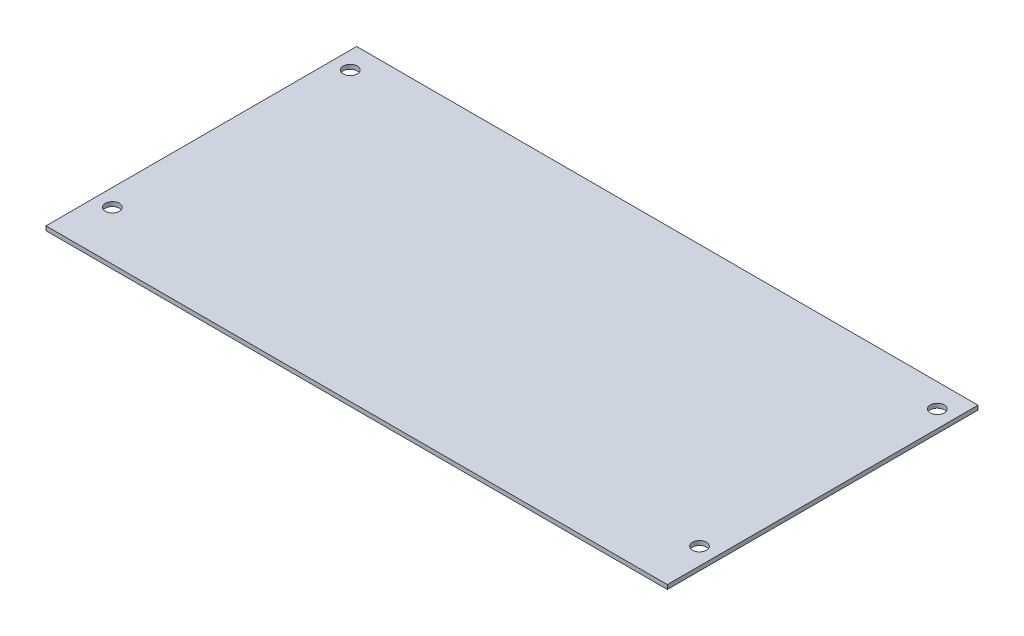
ISO-10303-21;
HEADER;
FILE_DESCRIPTION(('STEP AP214'),'2;1');
FILE_NAME('part.step','',(''),(''),'','','');
FILE_SCHEMA(('AUTOMOTIVE_DESIGN { 1 0 10303 214 1 1 1 1 }'));
ENDSEC;
DATA;
#1=APPLICATION_CONTEXT('core data for automotive mechanical design processes');
#2=APPLICATION_PROTOCOL_DEFINITION('international standard','automotive_design',2000,#1);
#3=PRODUCT_CONTEXT('',#1,'mechanical');
#4=PRODUCT('Part','Part','',(#3));
#5=PRODUCT_RELATED_PRODUCT_CATEGORY('part','',(#4));
#6=PRODUCT_DEFINITION_FORMATION('','',#4);
#7=PRODUCT_DEFINITION_CONTEXT('part definition',#1,'design');
#8=PRODUCT_DEFINITION('design','',#6,#7);
#9=PRODUCT_DEFINITION_SHAPE('','',#8);
#10=(LENGTH_UNIT() NAMED_UNIT(*) SI_UNIT(.MILLI.,.METRE.));
#11=(NAMED_UNIT(*) PLANE_ANGLE_UNIT() SI_UNIT($,.RADIAN.));
#12=(NAMED_UNIT(*) SI_UNIT($,.STERADIAN.) SOLID_ANGLE_UNIT());
#13=UNCERTAINTY_MEASURE_WITH_UNIT(LENGTH_MEASURE(1.E-05),#10,'distance_accuracy_value','');
#14=(GEOMETRIC_REPRESENTATION_CONTEXT(3) GLOBAL_UNCERTAINTY_ASSIGNED_CONTEXT((#13)) GLOBAL_UNIT_ASSIGNED_CONTEXT((#10,
#11,#12)) REPRESENTATION_CONTEXT('',''));
#15=CARTESIAN_POINT('',(0.,0.,0.));
#16=DIRECTION('',(0.,0.,1.));
#17=DIRECTION('',(1.,0.,0.));
#18=AXIS2_PLACEMENT_3D('',#15,#16,#17);
#19=CARTESIAN_POINT('',(0.,2.,0.));
#20=DIRECTION('',(0.,1.,0.));
#21=DIRECTION('',(0.,0.,1.));
#22=AXIS2_PLACEMENT_3D('',#19,#20,#21);
#23=PLANE('',#22);
#24=CARTESIAN_POINT('',(-8.,2.,-23.));
#25=DIRECTION('',(0.,1.,0.));
#26=DIRECTION('',(0.,0.,1.));
#27=AXIS2_PLACEMENT_3D('',#24,#25,#26);
#28=CIRCLE('',#27,3.25);
#29=CARTESIAN_POINT('',(-8.,2.,-19.75));
#30=VERTEX_POINT('',#29);
#31=EDGE_CURVE('E148',#30,#30,#28,.T.);
#32=ORIENTED_EDGE('',*,*,#31,.F.);
#33=EDGE_LOOP('',(#32));
#34=FACE_BOUND('',#33,.T.);
#35=CARTESIAN_POINT('',(-282.,2.,-134.));
#36=DIRECTION('',(0.,1.,0.));
#37=DIRECTION('',(0.,0.,1.));
#38=AXIS2_PLACEMENT_3D('',#35,#36,#37);
#39=CIRCLE('',#38,3.24999999999995);
#40=CARTESIAN_POINT('',(-282.,2.,-130.75));
#41=VERTEX_POINT('',#40);
#42=EDGE_CURVE('E118',#41,#41,#39,.T.);
#43=ORIENTED_EDGE('',*,*,#42,.F.);
#44=EDGE_LOOP('',(#43));
#45=FACE_BOUND('',#44,.T.);
#46=DIRECTION('',(0.,0.,-1.));
#47=VECTOR('',#46,1.);
#48=CARTESIAN_POINT('',(0.,2.,0.));
#49=LINE('',#48,#47);
#50=CARTESIAN_POINT('',(0.,2.,0.));
#51=VERTEX_POINT('',#50);
#52=CARTESIAN_POINT('',(0.,2.,-145.));
#53=VERTEX_POINT('',#52);
#54=EDGE_CURVE('E98',#51,#53,#49,.T.);
#55=ORIENTED_EDGE('',*,*,#54,.T.);
#56=DIRECTION('',(-1.,0.,0.));
#57=VECTOR('',#56,1.);
#58=CARTESIAN_POINT('',(0.,2.,-145.));
#59=LINE('',#58,#57);
#60=CARTESIAN_POINT('',(-290.,2.,-145.));
#61=VERTEX_POINT('',#60);
#62=EDGE_CURVE('E93',#53,#61,#59,.T.);
#63=ORIENTED_EDGE('',*,*,#62,.T.);
#64=DIRECTION('',(0.,0.,1.));
#65=VECTOR('',#64,1.);
#66=CARTESIAN_POINT('',(-290.,2.,0.));
#67=LINE('',#66,#65);
#68=CARTESIAN_POINT('',(-290.,2.,0.));
#69=VERTEX_POINT('',#68);
#70=EDGE_CURVE('E96',#61,#69,#67,.T.);
#71=ORIENTED_EDGE('',*,*,#70,.T.);
#72=DIRECTION('',(1.,0.,0.));
#73=VECTOR('',#72,1.);
#74=CARTESIAN_POINT('',(0.,2.,0.));
#75=LINE('',#74,#73);
#76=EDGE_CURVE('E63',#69,#51,#75,.T.);
#77=ORIENTED_EDGE('',*,*,#76,.T.);
#78=EDGE_LOOP('',(#55,#63,#71,#77));
#79=FACE_BOUND('',#78,.T.);
#80=CARTESIAN_POINT('',(-282.,2.,-23.));
#81=DIRECTION('',(0.,1.,0.));
#82=DIRECTION('',(0.,0.,1.));
#83=AXIS2_PLACEMENT_3D('',#80,#81,#82);
#84=CIRCLE('',#83,3.24999999999995);
#85=CARTESIAN_POINT('',(-282.,2.,-19.75));
#86=VERTEX_POINT('',#85);
#87=EDGE_CURVE('E140',#86,#86,#84,.T.);
#88=ORIENTED_EDGE('',*,*,#87,.F.);
#89=EDGE_LOOP('',(#88));
#90=FACE_BOUND('',#89,.T.);
#91=CARTESIAN_POINT('',(-8.,2.,-134.));
#92=DIRECTION('',(0.,1.,0.));
#93=DIRECTION('',(0.,0.,1.));
#94=AXIS2_PLACEMENT_3D('',#91,#92,#93);
#95=CIRCLE('',#94,3.25);
#96=CARTESIAN_POINT('',(-8.,2.,-130.75));
#97=VERTEX_POINT('',#96);
#98=EDGE_CURVE('E156',#97,#97,#95,.T.);
#99=ORIENTED_EDGE('',*,*,#98,.F.);
#100=EDGE_LOOP('',(#99));
#101=FACE_BOUND('',#100,.T.);
#102=ADVANCED_FACE('F45',(#34,#45,#79,#90,#101),#23,.T.);
#103=CARTESIAN_POINT('',(0.,0.,0.));
#104=DIRECTION('',(0.,1.,0.));
#105=DIRECTION('',(0.,0.,1.));
#106=AXIS2_PLACEMENT_3D('',#103,#104,#105);
#107=PLANE('',#106);
#108=DIRECTION('',(0.,0.,-1.));
#109=VECTOR('',#108,1.);
#110=CARTESIAN_POINT('',(0.,0.,0.));
#111=LINE('',#110,#109);
#112=CARTESIAN_POINT('',(0.,0.,0.));
#113=VERTEX_POINT('',#112);
#114=CARTESIAN_POINT('',(0.,0.,-145.));
#115=VERTEX_POINT('',#114);
#116=EDGE_CURVE('E114',#113,#115,#111,.T.);
#117=ORIENTED_EDGE('',*,*,#116,.F.);
#118=DIRECTION('',(1.,0.,0.));
#119=VECTOR('',#118,1.);
#120=CARTESIAN_POINT('',(0.,0.,0.));
#121=LINE('',#120,#119);
#122=CARTESIAN_POINT('',(-290.,0.,0.));
#123=VERTEX_POINT('',#122);
#124=EDGE_CURVE('E86',#123,#113,#121,.T.);
#125=ORIENTED_EDGE('',*,*,#124,.F.);
#126=DIRECTION('',(0.,0.,1.));
#127=VECTOR('',#126,1.);
#128=CARTESIAN_POINT('',(-290.,0.,0.));
#129=LINE('',#128,#127);
#130=CARTESIAN_POINT('',(-290.,0.,-145.));
#131=VERTEX_POINT('',#130);
#132=EDGE_CURVE('E80',#131,#123,#129,.T.);
#133=ORIENTED_EDGE('',*,*,#132,.F.);
#134=DIRECTION('',(-1.,0.,0.));
#135=VECTOR('',#134,1.);
#136=CARTESIAN_POINT('',(0.,0.,-145.));
#137=LINE('',#136,#135);
#138=EDGE_CURVE('E103',#115,#131,#137,.T.);
#139=ORIENTED_EDGE('',*,*,#138,.F.);
#140=EDGE_LOOP('',(#117,#125,#133,#139));
#141=FACE_BOUND('',#140,.T.);
#142=CARTESIAN_POINT('',(-282.,0.,-134.));
#143=DIRECTION('',(0.,1.,0.));
#144=DIRECTION('',(0.,0.,1.));
#145=AXIS2_PLACEMENT_3D('',#142,#143,#144);
#146=CIRCLE('',#145,3.24999999999995);
#147=CARTESIAN_POINT('',(-282.,0.,-130.75));
#148=VERTEX_POINT('',#147);
#149=EDGE_CURVE('E136',#148,#148,#146,.T.);
#150=ORIENTED_EDGE('',*,*,#149,.T.);
#151=EDGE_LOOP('',(#150));
#152=FACE_BOUND('',#151,.T.);
#153=CARTESIAN_POINT('',(-282.,0.,-23.));
#154=DIRECTION('',(0.,1.,0.));
#155=DIRECTION('',(0.,0.,1.));
#156=AXIS2_PLACEMENT_3D('',#153,#154,#155);
#157=CIRCLE('',#156,3.24999999999995);
#158=CARTESIAN_POINT('',(-282.,0.,-19.75));
#159=VERTEX_POINT('',#158);
#160=EDGE_CURVE('E144',#159,#159,#157,.T.);
#161=ORIENTED_EDGE('',*,*,#160,.T.);
#162=EDGE_LOOP('',(#161));
#163=FACE_BOUND('',#162,.T.);
#164=CARTESIAN_POINT('',(-8.,0.,-23.));
#165=DIRECTION('',(0.,1.,0.));
#166=DIRECTION('',(0.,0.,1.));
#167=AXIS2_PLACEMENT_3D('',#164,#165,#166);
#168=CIRCLE('',#167,3.25);
#169=CARTESIAN_POINT('',(-8.,0.,-19.75));
#170=VERTEX_POINT('',#169);
#171=EDGE_CURVE('E152',#170,#170,#168,.T.);
#172=ORIENTED_EDGE('',*,*,#171,.T.);
#173=EDGE_LOOP('',(#172));
#174=FACE_BOUND('',#173,.T.);
#175=CARTESIAN_POINT('',(-8.,0.,-134.));
#176=DIRECTION('',(0.,1.,0.));
#177=DIRECTION('',(0.,0.,1.));
#178=AXIS2_PLACEMENT_3D('',#175,#176,#177);
#179=CIRCLE('',#178,3.25);
#180=CARTESIAN_POINT('',(-8.,0.,-130.75));
#181=VERTEX_POINT('',#180);
#182=EDGE_CURVE('E160',#181,#181,#179,.T.);
#183=ORIENTED_EDGE('',*,*,#182,.T.);
#184=EDGE_LOOP('',(#183));
#185=FACE_BOUND('',#184,.T.);
#186=ADVANCED_FACE('F131',(#141,#152,#163,#174,#185),#107,.F.);
#187=CARTESIAN_POINT('',(0.,2.,0.));
#188=DIRECTION('',(-1.,0.,0.));
#189=DIRECTION('',(0.,0.,1.));
#190=AXIS2_PLACEMENT_3D('',#187,#188,#189);
#191=PLANE('',#190);
#192=ORIENTED_EDGE('',*,*,#116,.T.);
#193=DIRECTION('',(0.,-1.,0.));
#194=VECTOR('',#193,1.);
#195=CARTESIAN_POINT('',(0.,2.,-145.));
#196=LINE('',#195,#194);
#197=EDGE_CURVE('E11',#53,#115,#196,.T.);
#198=ORIENTED_EDGE('',*,*,#197,.F.);
#199=ORIENTED_EDGE('',*,*,#54,.F.);
#200=DIRECTION('',(0.,-1.,0.));
#201=VECTOR('',#200,1.);
#202=CARTESIAN_POINT('',(0.,2.,0.));
#203=LINE('',#202,#201);
#204=EDGE_CURVE('E110',#51,#113,#203,.T.);
#205=ORIENTED_EDGE('',*,*,#204,.T.);
#206=EDGE_LOOP('',(#192,#198,#199,#205));
#207=FACE_BOUND('',#206,.T.);
#208=ADVANCED_FACE('F47',(#207),#191,.F.);
#209=CARTESIAN_POINT('',(0.,2.,-145.));
#210=DIRECTION('',(0.,0.,1.));
#211=DIRECTION('',(1.,0.,0.));
#212=AXIS2_PLACEMENT_3D('',#209,#210,#211);
#213=PLANE('',#212);
#214=ORIENTED_EDGE('',*,*,#138,.T.);
#215=DIRECTION('',(0.,-1.,0.));
#216=VECTOR('',#215,1.);
#217=CARTESIAN_POINT('',(-290.,2.,-145.));
#218=LINE('',#217,#216);
#219=EDGE_CURVE('E55',#61,#131,#218,.T.);
#220=ORIENTED_EDGE('',*,*,#219,.F.);
#221=ORIENTED_EDGE('',*,*,#62,.F.);
#222=ORIENTED_EDGE('',*,*,#197,.T.);
#223=EDGE_LOOP('',(#214,#220,#221,#222));
#224=FACE_BOUND('',#223,.T.);
#225=ADVANCED_FACE('F102',(#224),#213,.F.);
#226=CARTESIAN_POINT('',(-290.,2.,0.));
#227=DIRECTION('',(1.,0.,0.));
#228=DIRECTION('',(0.,0.,-1.));
#229=AXIS2_PLACEMENT_3D('',#226,#227,#228);
#230=PLANE('',#229);
#231=ORIENTED_EDGE('',*,*,#132,.T.);
#232=DIRECTION('',(0.,-1.,0.));
#233=VECTOR('',#232,1.);
#234=CARTESIAN_POINT('',(-290.,2.,0.));
#235=LINE('',#234,#233);
#236=EDGE_CURVE('E105',#69,#123,#235,.T.);
#237=ORIENTED_EDGE('',*,*,#236,.F.);
#238=ORIENTED_EDGE('',*,*,#70,.F.);
#239=ORIENTED_EDGE('',*,*,#219,.T.);
#240=EDGE_LOOP('',(#231,#237,#238,#239));
#241=FACE_BOUND('',#240,.T.);
#242=ADVANCED_FACE('F106',(#241),#230,.F.);
#243=CARTESIAN_POINT('',(0.,2.,0.));
#244=DIRECTION('',(0.,0.,-1.));
#245=DIRECTION('',(-1.,0.,0.));
#246=AXIS2_PLACEMENT_3D('',#243,#244,#245);
#247=PLANE('',#246);
#248=ORIENTED_EDGE('',*,*,#124,.T.);
#249=ORIENTED_EDGE('',*,*,#204,.F.);
#250=ORIENTED_EDGE('',*,*,#76,.F.);
#251=ORIENTED_EDGE('',*,*,#236,.T.);
#252=EDGE_LOOP('',(#248,#249,#250,#251));
#253=FACE_BOUND('',#252,.T.);
#254=ADVANCED_FACE('F128',(#253),#247,.F.);
#255=CARTESIAN_POINT('',(-282.,2.,-134.));
#256=DIRECTION('',(0.,-1.,0.));
#257=DIRECTION('',(0.,0.,-1.));
#258=AXIS2_PLACEMENT_3D('',#255,#256,#257);
#259=CYLINDRICAL_SURFACE('',#258,3.24999999999995);
#260=ORIENTED_EDGE('',*,*,#42,.T.);
#261=EDGE_LOOP('',(#260));
#262=FACE_BOUND('',#261,.T.);
#263=ORIENTED_EDGE('',*,*,#149,.F.);
#264=EDGE_LOOP('',(#263));
#265=FACE_BOUND('',#264,.T.);
#266=ADVANCED_FACE('F181',(#262,#265),#259,.F.);
#267=CARTESIAN_POINT('',(-282.,2.,-23.));
#268=DIRECTION('',(0.,-1.,0.));
#269=DIRECTION('',(0.,0.,-1.));
#270=AXIS2_PLACEMENT_3D('',#267,#268,#269);
#271=CYLINDRICAL_SURFACE('',#270,3.24999999999995);
#272=ORIENTED_EDGE('',*,*,#87,.T.);
#273=EDGE_LOOP('',(#272));
#274=FACE_BOUND('',#273,.T.);
#275=ORIENTED_EDGE('',*,*,#160,.F.);
#276=EDGE_LOOP('',(#275));
#277=FACE_BOUND('',#276,.T.);
#278=ADVANCED_FACE('F226',(#274,#277),#271,.F.);
#279=CARTESIAN_POINT('',(-8.,2.,-23.));
#280=DIRECTION('',(0.,-1.,0.));
#281=DIRECTION('',(0.,0.,-1.));
#282=AXIS2_PLACEMENT_3D('',#279,#280,#281);
#283=CYLINDRICAL_SURFACE('',#282,3.25);
#284=ORIENTED_EDGE('',*,*,#31,.T.);
#285=EDGE_LOOP('',(#284));
#286=FACE_BOUND('',#285,.T.);
#287=ORIENTED_EDGE('',*,*,#171,.F.);
#288=EDGE_LOOP('',(#287));
#289=FACE_BOUND('',#288,.T.);
#290=ADVANCED_FACE('F234',(#286,#289),#283,.F.);
#291=CARTESIAN_POINT('',(-8.,2.,-134.));
#292=DIRECTION('',(0.,-1.,0.));
#293=DIRECTION('',(0.,0.,-1.));
#294=AXIS2_PLACEMENT_3D('',#291,#292,#293);
#295=CYLINDRICAL_SURFACE('',#294,3.25);
#296=ORIENTED_EDGE('',*,*,#98,.T.);
#297=EDGE_LOOP('',(#296));
#298=FACE_BOUND('',#297,.T.);
#299=ORIENTED_EDGE('',*,*,#182,.F.);
#300=EDGE_LOOP('',(#299));
#301=FACE_BOUND('',#300,.T.);
#302=ADVANCED_FACE('F168',(#298,#301),#295,.F.);
#303=CLOSED_SHELL('',(#102,#186,#208,#225,#242,#254,#266,#278,#290,#302));
#304=MANIFOLD_SOLID_BREP('B2',#303);
#305=ADVANCED_BREP_SHAPE_REPRESENTATION('',(#18,#304),#14);
#306=SHAPE_DEFINITION_REPRESENTATION(#9,#305);
ENDSEC;
END-ISO-10303-21;
